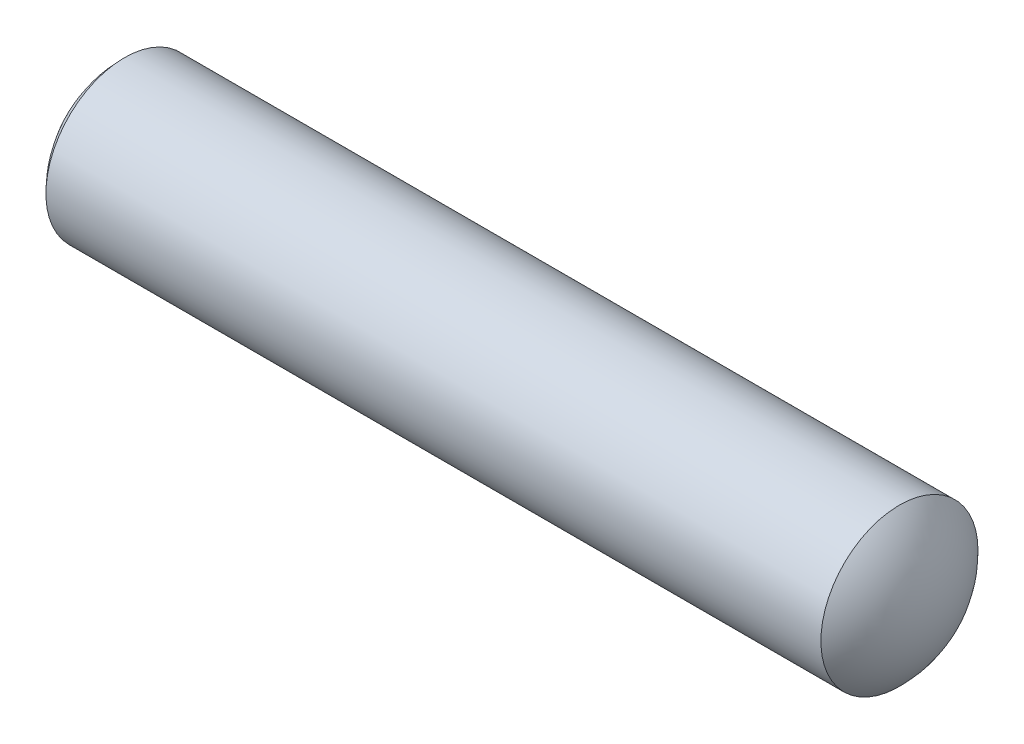
ISO-10303-21;
HEADER;
FILE_DESCRIPTION(('STEP AP214'),'2;1');
FILE_NAME('part.step','',(''),(''),'','','');
FILE_SCHEMA(('AUTOMOTIVE_DESIGN { 1 0 10303 214 1 1 1 1 }'));
ENDSEC;
DATA;
#1=APPLICATION_CONTEXT('core data for automotive mechanical design processes');
#2=APPLICATION_PROTOCOL_DEFINITION('international standard','automotive_design',2000,#1);
#3=PRODUCT_CONTEXT('',#1,'mechanical');
#4=PRODUCT('Part','Part','',(#3));
#5=PRODUCT_RELATED_PRODUCT_CATEGORY('part','',(#4));
#6=PRODUCT_DEFINITION_FORMATION('','',#4);
#7=PRODUCT_DEFINITION_CONTEXT('part definition',#1,'design');
#8=PRODUCT_DEFINITION('design','',#6,#7);
#9=PRODUCT_DEFINITION_SHAPE('','',#8);
#10=(LENGTH_UNIT() NAMED_UNIT(*) SI_UNIT(.MILLI.,.METRE.));
#11=(NAMED_UNIT(*) PLANE_ANGLE_UNIT() SI_UNIT($,.RADIAN.));
#12=(NAMED_UNIT(*) SI_UNIT($,.STERADIAN.) SOLID_ANGLE_UNIT());
#13=UNCERTAINTY_MEASURE_WITH_UNIT(LENGTH_MEASURE(1.E-05),#10,'distance_accuracy_value','');
#14=(GEOMETRIC_REPRESENTATION_CONTEXT(3) GLOBAL_UNCERTAINTY_ASSIGNED_CONTEXT((#13)) GLOBAL_UNIT_ASSIGNED_CONTEXT((#10,
#11,#12)) REPRESENTATION_CONTEXT('',''));
#15=CARTESIAN_POINT('',(0.,0.,0.));
#16=DIRECTION('',(0.,0.,1.));
#17=DIRECTION('',(1.,0.,0.));
#18=AXIS2_PLACEMENT_3D('',#15,#16,#17);
#19=CARTESIAN_POINT('',(15.1875,17.9292159184646,11.5224074220224));
#20=DIRECTION('',(0.,-0.540640817455597,0.841253532831182));
#21=DIRECTION('',(1.,0.,0.));
#22=AXIS2_PLACEMENT_3D('',#19,#20,#21);
#23=SPHERICAL_SURFACE('',#22,1.8375);
#24=CARTESIAN_POINT('',(15.1875,17.9292159184646,11.5224074220224));
#25=DIRECTION('',(-1.,0.,0.));
#26=DIRECTION('',(0.,-0.841253532831181,-0.540640817455598));
#27=AXIS2_PLACEMENT_3D('',#24,#25,#26);
#28=SPHERICAL_SURFACE('',#27,1.8375);
#29=CARTESIAN_POINT('',(16.4734821149612,17.9292159184646,11.5224074220224));
#30=DIRECTION('',(-1.,0.,0.));
#31=DIRECTION('',(0.,-0.841253532831181,-0.540640817455598));
#32=AXIS2_PLACEMENT_3D('',#29,#30,#31);
#33=CIRCLE('',#32,1.3125);
#34=CARTESIAN_POINT('',(16.4734821149612,16.8250706566237,10.8128163491119));
#35=VERTEX_POINT('',#34);
#36=EDGE_CURVE('E11',#35,#35,#33,.T.);
#37=ORIENTED_EDGE('',*,*,#36,.F.);
#38=EDGE_LOOP('',(#37));
#39=FACE_BOUND('',#38,.T.);
#40=ADVANCED_FACE('F17',(#39),#28,.T.);
#41=CARTESIAN_POINT('',(10.,17.9292159184645,11.5224074220224));
#42=DIRECTION('',(-1.,0.,0.));
#43=DIRECTION('',(0.,-0.841253532831181,-0.540640817455598));
#44=AXIS2_PLACEMENT_3D('',#41,#42,#43);
#45=CYLINDRICAL_SURFACE('',#44,1.3125);
#46=CARTESIAN_POINT('',(3.52651788503884,17.9292159184645,11.5224074220224));
#47=DIRECTION('',(-1.,0.,0.));
#48=DIRECTION('',(0.,-0.841253532831181,-0.540640817455598));
#49=AXIS2_PLACEMENT_3D('',#46,#47,#48);
#50=CIRCLE('',#49,1.3125);
#51=CARTESIAN_POINT('',(3.52651788503884,16.8250706566236,10.8128163491119));
#52=VERTEX_POINT('',#51);
#53=EDGE_CURVE('E26',#52,#52,#50,.T.);
#54=ORIENTED_EDGE('',*,*,#53,.F.);
#55=EDGE_LOOP('',(#54));
#56=FACE_BOUND('',#55,.T.);
#57=ORIENTED_EDGE('',*,*,#36,.T.);
#58=EDGE_LOOP('',(#57));
#59=FACE_BOUND('',#58,.T.);
#60=ADVANCED_FACE('F19',(#56,#59),#45,.T.);
#61=CARTESIAN_POINT('',(4.8125,17.9292159184645,11.5224074220224));
#62=DIRECTION('',(0.,-0.540640817455597,0.841253532831182));
#63=DIRECTION('',(-1.,0.,0.));
#64=AXIS2_PLACEMENT_3D('',#61,#62,#63);
#65=SPHERICAL_SURFACE('',#64,1.8375);
#66=CARTESIAN_POINT('',(4.8125,17.9292159184645,11.5224074220224));
#67=DIRECTION('',(-1.,0.,0.));
#68=DIRECTION('',(0.,-0.841253532831181,-0.540640817455598));
#69=AXIS2_PLACEMENT_3D('',#66,#67,#68);
#70=SPHERICAL_SURFACE('',#69,1.8375);
#71=ORIENTED_EDGE('',*,*,#53,.T.);
#72=EDGE_LOOP('',(#71));
#73=FACE_BOUND('',#72,.T.);
#74=ADVANCED_FACE('F40',(#73),#70,.T.);
#75=CLOSED_SHELL('',(#40,#60,#74));
#76=MANIFOLD_SOLID_BREP('B1',#75);
#77=ADVANCED_BREP_SHAPE_REPRESENTATION('',(#18,#76),#14);
#78=SHAPE_DEFINITION_REPRESENTATION(#9,#77);
ENDSEC;
END-ISO-10303-21;
